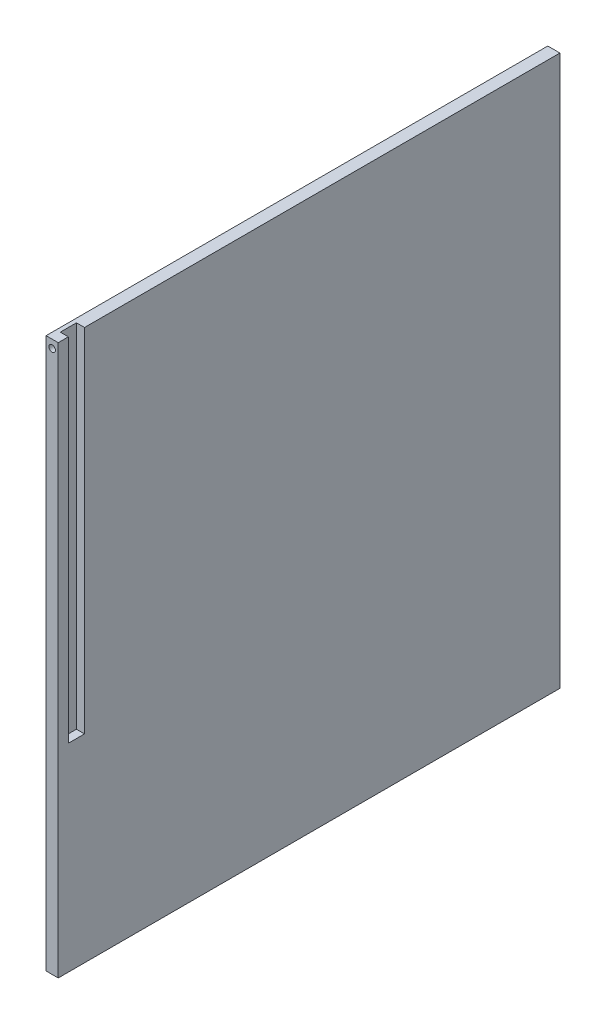
ISO-10303-21;
HEADER;
FILE_DESCRIPTION(('STEP AP214'),'2;1');
FILE_NAME('part.step','',(''),(''),'','','');
FILE_SCHEMA(('AUTOMOTIVE_DESIGN { 1 0 10303 214 1 1 1 1 }'));
ENDSEC;
DATA;
#1=APPLICATION_CONTEXT('core data for automotive mechanical design processes');
#2=APPLICATION_PROTOCOL_DEFINITION('international standard','automotive_design',2000,#1);
#3=PRODUCT_CONTEXT('',#1,'mechanical');
#4=PRODUCT('Part','Part','',(#3));
#5=PRODUCT_RELATED_PRODUCT_CATEGORY('part','',(#4));
#6=PRODUCT_DEFINITION_FORMATION('','',#4);
#7=PRODUCT_DEFINITION_CONTEXT('part definition',#1,'design');
#8=PRODUCT_DEFINITION('design','',#6,#7);
#9=PRODUCT_DEFINITION_SHAPE('','',#8);
#10=(LENGTH_UNIT() NAMED_UNIT(*) SI_UNIT(.MILLI.,.METRE.));
#11=(NAMED_UNIT(*) PLANE_ANGLE_UNIT() SI_UNIT($,.RADIAN.));
#12=(NAMED_UNIT(*) SI_UNIT($,.STERADIAN.) SOLID_ANGLE_UNIT());
#13=UNCERTAINTY_MEASURE_WITH_UNIT(LENGTH_MEASURE(1.E-05),#10,'distance_accuracy_value','');
#14=(GEOMETRIC_REPRESENTATION_CONTEXT(3) GLOBAL_UNCERTAINTY_ASSIGNED_CONTEXT((#13)) GLOBAL_UNIT_ASSIGNED_CONTEXT((#10,
#11,#12)) REPRESENTATION_CONTEXT('',''));
#15=CARTESIAN_POINT('',(0.,0.,0.));
#16=DIRECTION('',(0.,0.,1.));
#17=DIRECTION('',(1.,0.,0.));
#18=AXIS2_PLACEMENT_3D('',#15,#16,#17);
#19=CARTESIAN_POINT('',(15.,0.,310.));
#20=DIRECTION('',(0.,0.,-1.));
#21=DIRECTION('',(-1.,0.,0.));
#22=AXIS2_PLACEMENT_3D('',#19,#20,#21);
#23=PLANE('',#22);
#24=CARTESIAN_POINT('',(7.5,670.,310.));
#25=DIRECTION('',(0.,0.,1.));
#26=DIRECTION('',(1.,0.,0.));
#27=AXIS2_PLACEMENT_3D('',#24,#25,#26);
#28=CIRCLE('',#27,4.);
#29=CARTESIAN_POINT('',(11.5,670.,310.));
#30=VERTEX_POINT('',#29);
#31=EDGE_CURVE('E174',#30,#30,#28,.T.);
#32=ORIENTED_EDGE('',*,*,#31,.F.);
#33=EDGE_LOOP('',(#32));
#34=FACE_BOUND('',#33,.T.);
#35=DIRECTION('',(0.,-1.,0.));
#36=VECTOR('',#35,1.);
#37=CARTESIAN_POINT('',(0.,0.,310.));
#38=LINE('',#37,#36);
#39=CARTESIAN_POINT('',(0.,680.,310.));
#40=VERTEX_POINT('',#39);
#41=CARTESIAN_POINT('',(0.,0.,310.));
#42=VERTEX_POINT('',#41);
#43=EDGE_CURVE('E145',#40,#42,#38,.T.);
#44=ORIENTED_EDGE('',*,*,#43,.T.);
#45=DIRECTION('',(-1.,0.,0.));
#46=VECTOR('',#45,1.);
#47=CARTESIAN_POINT('',(15.,0.,310.));
#48=LINE('',#47,#46);
#49=CARTESIAN_POINT('',(15.,0.,310.));
#50=VERTEX_POINT('',#49);
#51=EDGE_CURVE('E12',#50,#42,#48,.T.);
#52=ORIENTED_EDGE('',*,*,#51,.F.);
#53=DIRECTION('',(0.,-1.,0.));
#54=VECTOR('',#53,1.);
#55=CARTESIAN_POINT('',(15.,0.,310.));
#56=LINE('',#55,#54);
#57=CARTESIAN_POINT('',(15.,680.,310.));
#58=VERTEX_POINT('',#57);
#59=EDGE_CURVE('E153',#58,#50,#56,.T.);
#60=ORIENTED_EDGE('',*,*,#59,.F.);
#61=DIRECTION('',(-1.,0.,0.));
#62=VECTOR('',#61,1.);
#63=CARTESIAN_POINT('',(15.,680.,310.));
#64=LINE('',#63,#62);
#65=EDGE_CURVE('E138',#58,#40,#64,.T.);
#66=ORIENTED_EDGE('',*,*,#65,.T.);
#67=EDGE_LOOP('',(#44,#52,#60,#66));
#68=FACE_BOUND('',#67,.T.);
#69=ADVANCED_FACE('F40',(#34,#68),#23,.F.);
#70=CARTESIAN_POINT('',(15.,0.,310.));
#71=DIRECTION('',(0.,1.,0.));
#72=DIRECTION('',(0.,0.,1.));
#73=AXIS2_PLACEMENT_3D('',#70,#71,#72);
#74=PLANE('',#73);
#75=DIRECTION('',(0.,0.,-1.));
#76=VECTOR('',#75,1.);
#77=CARTESIAN_POINT('',(0.,0.,310.));
#78=LINE('',#77,#76);
#79=CARTESIAN_POINT('',(0.,0.,-310.));
#80=VERTEX_POINT('',#79);
#81=EDGE_CURVE('E148',#42,#80,#78,.T.);
#82=ORIENTED_EDGE('',*,*,#81,.T.);
#83=DIRECTION('',(-1.,0.,0.));
#84=VECTOR('',#83,1.);
#85=CARTESIAN_POINT('',(15.,0.,-310.));
#86=LINE('',#85,#84);
#87=CARTESIAN_POINT('',(15.,0.,-310.));
#88=VERTEX_POINT('',#87);
#89=EDGE_CURVE('E47',#88,#80,#86,.T.);
#90=ORIENTED_EDGE('',*,*,#89,.F.);
#91=DIRECTION('',(0.,0.,-1.));
#92=VECTOR('',#91,1.);
#93=CARTESIAN_POINT('',(15.,0.,310.));
#94=LINE('',#93,#92);
#95=EDGE_CURVE('E91',#50,#88,#94,.T.);
#96=ORIENTED_EDGE('',*,*,#95,.F.);
#97=ORIENTED_EDGE('',*,*,#51,.T.);
#98=EDGE_LOOP('',(#82,#90,#96,#97));
#99=FACE_BOUND('',#98,.T.);
#100=ADVANCED_FACE('F235',(#99),#74,.F.);
#101=CARTESIAN_POINT('',(15.,0.,-310.));
#102=DIRECTION('',(0.,0.,1.));
#103=DIRECTION('',(1.,0.,0.));
#104=AXIS2_PLACEMENT_3D('',#101,#102,#103);
#105=PLANE('',#104);
#106=CARTESIAN_POINT('',(7.5,665.,-310.));
#107=DIRECTION('',(0.,0.,-1.));
#108=DIRECTION('',(-1.,0.,0.));
#109=AXIS2_PLACEMENT_3D('',#106,#107,#108);
#110=CIRCLE('',#109,4.);
#111=CARTESIAN_POINT('',(3.5,665.,-310.));
#112=VERTEX_POINT('',#111);
#113=EDGE_CURVE('E179',#112,#112,#110,.T.);
#114=ORIENTED_EDGE('',*,*,#113,.F.);
#115=EDGE_LOOP('',(#114));
#116=FACE_BOUND('',#115,.T.);
#117=CARTESIAN_POINT('',(7.5,340.,-310.));
#118=DIRECTION('',(0.,0.,-1.));
#119=DIRECTION('',(-1.,0.,0.));
#120=AXIS2_PLACEMENT_3D('',#117,#118,#119);
#121=CIRCLE('',#120,4.);
#122=CARTESIAN_POINT('',(3.5,340.,-310.));
#123=VERTEX_POINT('',#122);
#124=EDGE_CURVE('E187',#123,#123,#121,.T.);
#125=ORIENTED_EDGE('',*,*,#124,.F.);
#126=EDGE_LOOP('',(#125));
#127=FACE_BOUND('',#126,.T.);
#128=CARTESIAN_POINT('',(7.5,15.,-310.));
#129=DIRECTION('',(0.,0.,-1.));
#130=DIRECTION('',(-1.,0.,0.));
#131=AXIS2_PLACEMENT_3D('',#128,#129,#130);
#132=CIRCLE('',#131,4.);
#133=CARTESIAN_POINT('',(3.5,15.,-310.));
#134=VERTEX_POINT('',#133);
#135=EDGE_CURVE('E193',#134,#134,#132,.T.);
#136=ORIENTED_EDGE('',*,*,#135,.F.);
#137=EDGE_LOOP('',(#136));
#138=FACE_BOUND('',#137,.T.);
#139=DIRECTION('',(0.,1.,0.));
#140=VECTOR('',#139,1.);
#141=CARTESIAN_POINT('',(0.,0.,-310.));
#142=LINE('',#141,#140);
#143=CARTESIAN_POINT('',(0.,680.,-310.));
#144=VERTEX_POINT('',#143);
#145=EDGE_CURVE('E151',#80,#144,#142,.T.);
#146=ORIENTED_EDGE('',*,*,#145,.T.);
#147=DIRECTION('',(-1.,0.,0.));
#148=VECTOR('',#147,1.);
#149=CARTESIAN_POINT('',(15.,680.,-310.));
#150=LINE('',#149,#148);
#151=CARTESIAN_POINT('',(15.,680.,-310.));
#152=VERTEX_POINT('',#151);
#153=EDGE_CURVE('E140',#152,#144,#150,.T.);
#154=ORIENTED_EDGE('',*,*,#153,.F.);
#155=DIRECTION('',(0.,1.,0.));
#156=VECTOR('',#155,1.);
#157=CARTESIAN_POINT('',(15.,0.,-310.));
#158=LINE('',#157,#156);
#159=EDGE_CURVE('E136',#88,#152,#158,.T.);
#160=ORIENTED_EDGE('',*,*,#159,.F.);
#161=ORIENTED_EDGE('',*,*,#89,.T.);
#162=EDGE_LOOP('',(#146,#154,#160,#161));
#163=FACE_BOUND('',#162,.T.);
#164=ADVANCED_FACE('F158',(#116,#127,#138,#163),#105,.F.);
#165=CARTESIAN_POINT('',(15.,680.,310.));
#166=DIRECTION('',(0.,-1.,0.));
#167=DIRECTION('',(0.,0.,-1.));
#168=AXIS2_PLACEMENT_3D('',#165,#166,#167);
#169=PLANE('',#168);
#170=DIRECTION('',(0.,0.,1.));
#171=VECTOR('',#170,1.);
#172=CARTESIAN_POINT('',(15.,680.,310.));
#173=LINE('',#172,#171);
#174=CARTESIAN_POINT('',(15.,680.,297.5));
#175=VERTEX_POINT('',#174);
#176=EDGE_CURVE('E62',#175,#58,#173,.T.);
#177=ORIENTED_EDGE('',*,*,#176,.F.);
#178=DIRECTION('',(1.,0.,0.));
#179=VECTOR('',#178,1.);
#180=CARTESIAN_POINT('',(15.,680.,297.5));
#181=LINE('',#180,#179);
#182=CARTESIAN_POINT('',(5.,680.,297.5));
#183=VERTEX_POINT('',#182);
#184=EDGE_CURVE('E125',#183,#175,#181,.T.);
#185=ORIENTED_EDGE('',*,*,#184,.F.);
#186=DIRECTION('',(0.,0.,1.));
#187=VECTOR('',#186,1.);
#188=CARTESIAN_POINT('',(5.,680.,297.5));
#189=LINE('',#188,#187);
#190=CARTESIAN_POINT('',(4.99999999999999,680.,277.5));
#191=VERTEX_POINT('',#190);
#192=EDGE_CURVE('E132',#191,#183,#189,.T.);
#193=ORIENTED_EDGE('',*,*,#192,.F.);
#194=DIRECTION('',(-1.,0.,0.));
#195=VECTOR('',#194,1.);
#196=CARTESIAN_POINT('',(15.,680.,277.5));
#197=LINE('',#196,#195);
#198=CARTESIAN_POINT('',(15.,680.,277.5));
#199=VERTEX_POINT('',#198);
#200=EDGE_CURVE('E117',#199,#191,#197,.T.);
#201=ORIENTED_EDGE('',*,*,#200,.F.);
#202=EDGE_CURVE('E129',#152,#199,#173,.T.);
#203=ORIENTED_EDGE('',*,*,#202,.F.);
#204=ORIENTED_EDGE('',*,*,#153,.T.);
#205=DIRECTION('',(0.,0.,1.));
#206=VECTOR('',#205,1.);
#207=CARTESIAN_POINT('',(0.,680.,310.));
#208=LINE('',#207,#206);
#209=EDGE_CURVE('E84',#144,#40,#208,.T.);
#210=ORIENTED_EDGE('',*,*,#209,.T.);
#211=ORIENTED_EDGE('',*,*,#65,.F.);
#212=EDGE_LOOP('',(#177,#185,#193,#201,#203,#204,#210,#211));
#213=FACE_BOUND('',#212,.T.);
#214=ADVANCED_FACE('F128',(#213),#169,.F.);
#215=CARTESIAN_POINT('',(15.,0.,0.));
#216=DIRECTION('',(-1.,0.,0.));
#217=DIRECTION('',(0.,0.,1.));
#218=AXIS2_PLACEMENT_3D('',#215,#216,#217);
#219=PLANE('',#218);
#220=DIRECTION('',(0.,0.,1.));
#221=VECTOR('',#220,1.);
#222=CARTESIAN_POINT('',(15.,245.,297.5));
#223=LINE('',#222,#221);
#224=CARTESIAN_POINT('',(15.,245.,277.5));
#225=VERTEX_POINT('',#224);
#226=CARTESIAN_POINT('',(15.,245.,297.5));
#227=VERTEX_POINT('',#226);
#228=EDGE_CURVE('E175',#225,#227,#223,.T.);
#229=ORIENTED_EDGE('',*,*,#228,.T.);
#230=DIRECTION('',(0.,1.,0.));
#231=VECTOR('',#230,1.);
#232=CARTESIAN_POINT('',(15.,-22.3606797749979,297.5));
#233=LINE('',#232,#231);
#234=EDGE_CURVE('E54',#227,#175,#233,.T.);
#235=ORIENTED_EDGE('',*,*,#234,.T.);
#236=ORIENTED_EDGE('',*,*,#176,.T.);
#237=ORIENTED_EDGE('',*,*,#59,.T.);
#238=ORIENTED_EDGE('',*,*,#95,.T.);
#239=ORIENTED_EDGE('',*,*,#159,.T.);
#240=ORIENTED_EDGE('',*,*,#202,.T.);
#241=DIRECTION('',(0.,1.,0.));
#242=VECTOR('',#241,1.);
#243=CARTESIAN_POINT('',(15.,-22.3606797749979,277.5));
#244=LINE('',#243,#242);
#245=EDGE_CURVE('E113',#225,#199,#244,.T.);
#246=ORIENTED_EDGE('',*,*,#245,.F.);
#247=EDGE_LOOP('',(#229,#235,#236,#237,#238,#239,#240,#246));
#248=FACE_BOUND('',#247,.T.);
#249=ADVANCED_FACE('F134',(#248),#219,.F.);
#250=CARTESIAN_POINT('',(0.,0.,0.));
#251=DIRECTION('',(-1.,0.,0.));
#252=DIRECTION('',(0.,0.,1.));
#253=AXIS2_PLACEMENT_3D('',#250,#251,#252);
#254=PLANE('',#253);
#255=CARTESIAN_POINT('',(0.,7.5,-295.));
#256=DIRECTION('',(-1.,0.,0.));
#257=DIRECTION('',(0.,0.,1.));
#258=AXIS2_PLACEMENT_3D('',#255,#256,#257);
#259=CIRCLE('',#258,3.99999999999999);
#260=CARTESIAN_POINT('',(0.,7.5,-291.));
#261=VERTEX_POINT('',#260);
#262=EDGE_CURVE('E197',#261,#261,#259,.T.);
#263=ORIENTED_EDGE('',*,*,#262,.F.);
#264=EDGE_LOOP('',(#263));
#265=FACE_BOUND('',#264,.T.);
#266=CARTESIAN_POINT('',(0.,7.5,0.));
#267=DIRECTION('',(-1.,0.,0.));
#268=DIRECTION('',(0.,0.,1.));
#269=AXIS2_PLACEMENT_3D('',#266,#267,#268);
#270=CIRCLE('',#269,3.99999999999999);
#271=CARTESIAN_POINT('',(0.,7.5,3.99999999999999));
#272=VERTEX_POINT('',#271);
#273=EDGE_CURVE('E205',#272,#272,#270,.T.);
#274=ORIENTED_EDGE('',*,*,#273,.F.);
#275=EDGE_LOOP('',(#274));
#276=FACE_BOUND('',#275,.T.);
#277=CARTESIAN_POINT('',(0.,7.5,295.));
#278=DIRECTION('',(-1.,0.,0.));
#279=DIRECTION('',(0.,0.,1.));
#280=AXIS2_PLACEMENT_3D('',#277,#278,#279);
#281=CIRCLE('',#280,3.99999999999999);
#282=CARTESIAN_POINT('',(0.,7.5,299.));
#283=VERTEX_POINT('',#282);
#284=EDGE_CURVE('E211',#283,#283,#281,.T.);
#285=ORIENTED_EDGE('',*,*,#284,.F.);
#286=EDGE_LOOP('',(#285));
#287=FACE_BOUND('',#286,.T.);
#288=ORIENTED_EDGE('',*,*,#43,.F.);
#289=ORIENTED_EDGE('',*,*,#209,.F.);
#290=ORIENTED_EDGE('',*,*,#145,.F.);
#291=ORIENTED_EDGE('',*,*,#81,.F.);
#292=EDGE_LOOP('',(#288,#289,#290,#291));
#293=FACE_BOUND('',#292,.T.);
#294=ADVANCED_FACE('F161',(#265,#276,#287,#293),#254,.T.);
#295=CARTESIAN_POINT('',(10.,7.5,295.));
#296=DIRECTION('',(-1.,0.,0.));
#297=DIRECTION('',(0.,0.,1.));
#298=AXIS2_PLACEMENT_3D('',#295,#296,#297);
#299=CYLINDRICAL_SURFACE('',#298,3.99999999999999);
#300=CARTESIAN_POINT('',(10.,7.5,295.));
#301=DIRECTION('',(-1.,0.,0.));
#302=DIRECTION('',(0.,0.,1.));
#303=AXIS2_PLACEMENT_3D('',#300,#301,#302);
#304=CIRCLE('',#303,3.99999999999999);
#305=CARTESIAN_POINT('',(10.,7.5,299.));
#306=VERTEX_POINT('',#305);
#307=EDGE_CURVE('E149',#306,#306,#304,.T.);
#308=ORIENTED_EDGE('',*,*,#307,.F.);
#309=EDGE_LOOP('',(#308));
#310=FACE_BOUND('',#309,.T.);
#311=ORIENTED_EDGE('',*,*,#284,.T.);
#312=EDGE_LOOP('',(#311));
#313=FACE_BOUND('',#312,.T.);
#314=ADVANCED_FACE('F218',(#310,#313),#299,.F.);
#315=CARTESIAN_POINT('',(10.,7.5,295.));
#316=DIRECTION('',(-1.,0.,0.));
#317=DIRECTION('',(0.,0.,1.));
#318=AXIS2_PLACEMENT_3D('',#315,#316,#317);
#319=PLANE('',#318);
#320=ORIENTED_EDGE('',*,*,#307,.T.);
#321=EDGE_LOOP('',(#320));
#322=FACE_BOUND('',#321,.T.);
#323=ADVANCED_FACE('F227',(#322),#319,.T.);
#324=CARTESIAN_POINT('',(10.,7.5,0.));
#325=DIRECTION('',(-1.,0.,0.));
#326=DIRECTION('',(0.,0.,1.));
#327=AXIS2_PLACEMENT_3D('',#324,#325,#326);
#328=CYLINDRICAL_SURFACE('',#327,3.99999999999999);
#329=CARTESIAN_POINT('',(10.,7.5,0.));
#330=DIRECTION('',(-1.,0.,0.));
#331=DIRECTION('',(0.,0.,1.));
#332=AXIS2_PLACEMENT_3D('',#329,#330,#331);
#333=CIRCLE('',#332,3.99999999999999);
#334=CARTESIAN_POINT('',(10.,7.5,3.99999999999999));
#335=VERTEX_POINT('',#334);
#336=EDGE_CURVE('E208',#335,#335,#333,.T.);
#337=ORIENTED_EDGE('',*,*,#336,.F.);
#338=EDGE_LOOP('',(#337));
#339=FACE_BOUND('',#338,.T.);
#340=ORIENTED_EDGE('',*,*,#273,.T.);
#341=EDGE_LOOP('',(#340));
#342=FACE_BOUND('',#341,.T.);
#343=ADVANCED_FACE('F291',(#339,#342),#328,.F.);
#344=CARTESIAN_POINT('',(10.,7.5,0.));
#345=DIRECTION('',(-1.,0.,0.));
#346=DIRECTION('',(0.,0.,1.));
#347=AXIS2_PLACEMENT_3D('',#344,#345,#346);
#348=PLANE('',#347);
#349=ORIENTED_EDGE('',*,*,#336,.T.);
#350=EDGE_LOOP('',(#349));
#351=FACE_BOUND('',#350,.T.);
#352=ADVANCED_FACE('F287',(#351),#348,.T.);
#353=CARTESIAN_POINT('',(10.,7.5,-295.));
#354=DIRECTION('',(-1.,0.,0.));
#355=DIRECTION('',(0.,0.,1.));
#356=AXIS2_PLACEMENT_3D('',#353,#354,#355);
#357=CYLINDRICAL_SURFACE('',#356,3.99999999999999);
#358=CARTESIAN_POINT('',(10.,7.5,-295.));
#359=DIRECTION('',(-1.,0.,0.));
#360=DIRECTION('',(0.,0.,1.));
#361=AXIS2_PLACEMENT_3D('',#358,#359,#360);
#362=CIRCLE('',#361,3.99999999999999);
#363=CARTESIAN_POINT('',(10.,7.5,-291.));
#364=VERTEX_POINT('',#363);
#365=EDGE_CURVE('E202',#364,#364,#362,.T.);
#366=ORIENTED_EDGE('',*,*,#365,.F.);
#367=EDGE_LOOP('',(#366));
#368=FACE_BOUND('',#367,.T.);
#369=ORIENTED_EDGE('',*,*,#262,.T.);
#370=EDGE_LOOP('',(#369));
#371=FACE_BOUND('',#370,.T.);
#372=ADVANCED_FACE('F283',(#368,#371),#357,.F.);
#373=CARTESIAN_POINT('',(10.,7.5,-295.));
#374=DIRECTION('',(-1.,0.,0.));
#375=DIRECTION('',(0.,0.,1.));
#376=AXIS2_PLACEMENT_3D('',#373,#374,#375);
#377=PLANE('',#376);
#378=ORIENTED_EDGE('',*,*,#365,.T.);
#379=EDGE_LOOP('',(#378));
#380=FACE_BOUND('',#379,.T.);
#381=ADVANCED_FACE('F279',(#380),#377,.T.);
#382=CARTESIAN_POINT('',(7.5,15.,-300.));
#383=DIRECTION('',(0.,0.,-1.));
#384=DIRECTION('',(-1.,0.,0.));
#385=AXIS2_PLACEMENT_3D('',#382,#383,#384);
#386=CYLINDRICAL_SURFACE('',#385,4.);
#387=CARTESIAN_POINT('',(7.5,15.,-300.));
#388=DIRECTION('',(0.,0.,-1.));
#389=DIRECTION('',(-1.,0.,0.));
#390=AXIS2_PLACEMENT_3D('',#387,#388,#389);
#391=CIRCLE('',#390,4.);
#392=CARTESIAN_POINT('',(3.5,15.,-300.));
#393=VERTEX_POINT('',#392);
#394=EDGE_CURVE('E194',#393,#393,#391,.T.);
#395=ORIENTED_EDGE('',*,*,#394,.F.);
#396=EDGE_LOOP('',(#395));
#397=FACE_BOUND('',#396,.T.);
#398=ORIENTED_EDGE('',*,*,#135,.T.);
#399=EDGE_LOOP('',(#398));
#400=FACE_BOUND('',#399,.T.);
#401=ADVANCED_FACE('F275',(#397,#400),#386,.F.);
#402=CARTESIAN_POINT('',(7.5,15.,-300.));
#403=DIRECTION('',(0.,0.,-1.));
#404=DIRECTION('',(-1.,0.,0.));
#405=AXIS2_PLACEMENT_3D('',#402,#403,#404);
#406=PLANE('',#405);
#407=ORIENTED_EDGE('',*,*,#394,.T.);
#408=EDGE_LOOP('',(#407));
#409=FACE_BOUND('',#408,.T.);
#410=ADVANCED_FACE('F271',(#409),#406,.T.);
#411=CARTESIAN_POINT('',(7.5,340.,-300.));
#412=DIRECTION('',(0.,0.,-1.));
#413=DIRECTION('',(-1.,0.,0.));
#414=AXIS2_PLACEMENT_3D('',#411,#412,#413);
#415=CYLINDRICAL_SURFACE('',#414,4.);
#416=CARTESIAN_POINT('',(7.5,340.,-300.));
#417=DIRECTION('',(0.,0.,-1.));
#418=DIRECTION('',(-1.,0.,0.));
#419=AXIS2_PLACEMENT_3D('',#416,#417,#418);
#420=CIRCLE('',#419,4.);
#421=CARTESIAN_POINT('',(3.5,340.,-300.));
#422=VERTEX_POINT('',#421);
#423=EDGE_CURVE('E190',#422,#422,#420,.T.);
#424=ORIENTED_EDGE('',*,*,#423,.F.);
#425=EDGE_LOOP('',(#424));
#426=FACE_BOUND('',#425,.T.);
#427=ORIENTED_EDGE('',*,*,#124,.T.);
#428=EDGE_LOOP('',(#427));
#429=FACE_BOUND('',#428,.T.);
#430=ADVANCED_FACE('F267',(#426,#429),#415,.F.);
#431=CARTESIAN_POINT('',(7.5,340.,-300.));
#432=DIRECTION('',(0.,0.,-1.));
#433=DIRECTION('',(-1.,0.,0.));
#434=AXIS2_PLACEMENT_3D('',#431,#432,#433);
#435=PLANE('',#434);
#436=ORIENTED_EDGE('',*,*,#423,.T.);
#437=EDGE_LOOP('',(#436));
#438=FACE_BOUND('',#437,.T.);
#439=ADVANCED_FACE('F263',(#438),#435,.T.);
#440=CARTESIAN_POINT('',(7.5,665.,-300.));
#441=DIRECTION('',(0.,0.,-1.));
#442=DIRECTION('',(-1.,0.,0.));
#443=AXIS2_PLACEMENT_3D('',#440,#441,#442);
#444=CYLINDRICAL_SURFACE('',#443,4.);
#445=CARTESIAN_POINT('',(7.5,665.,-300.));
#446=DIRECTION('',(0.,0.,-1.));
#447=DIRECTION('',(-1.,0.,0.));
#448=AXIS2_PLACEMENT_3D('',#445,#446,#447);
#449=CIRCLE('',#448,4.);
#450=CARTESIAN_POINT('',(3.5,665.,-300.));
#451=VERTEX_POINT('',#450);
#452=EDGE_CURVE('E184',#451,#451,#449,.T.);
#453=ORIENTED_EDGE('',*,*,#452,.F.);
#454=EDGE_LOOP('',(#453));
#455=FACE_BOUND('',#454,.T.);
#456=ORIENTED_EDGE('',*,*,#113,.T.);
#457=EDGE_LOOP('',(#456));
#458=FACE_BOUND('',#457,.T.);
#459=ADVANCED_FACE('F255',(#455,#458),#444,.F.);
#460=CARTESIAN_POINT('',(7.5,665.,-300.));
#461=DIRECTION('',(0.,0.,-1.));
#462=DIRECTION('',(-1.,0.,0.));
#463=AXIS2_PLACEMENT_3D('',#460,#461,#462);
#464=PLANE('',#463);
#465=ORIENTED_EDGE('',*,*,#452,.T.);
#466=EDGE_LOOP('',(#465));
#467=FACE_BOUND('',#466,.T.);
#468=ADVANCED_FACE('F245',(#467),#464,.T.);
#469=CARTESIAN_POINT('',(7.5,670.,300.));
#470=DIRECTION('',(0.,0.,1.));
#471=DIRECTION('',(1.,0.,0.));
#472=AXIS2_PLACEMENT_3D('',#469,#470,#471);
#473=CYLINDRICAL_SURFACE('',#472,4.);
#474=CARTESIAN_POINT('',(7.5,670.,300.));
#475=DIRECTION('',(0.,0.,1.));
#476=DIRECTION('',(1.,0.,0.));
#477=AXIS2_PLACEMENT_3D('',#474,#475,#476);
#478=CIRCLE('',#477,4.);
#479=CARTESIAN_POINT('',(11.5,670.,300.));
#480=VERTEX_POINT('',#479);
#481=EDGE_CURVE('E176',#480,#480,#478,.T.);
#482=ORIENTED_EDGE('',*,*,#481,.F.);
#483=EDGE_LOOP('',(#482));
#484=FACE_BOUND('',#483,.T.);
#485=ORIENTED_EDGE('',*,*,#31,.T.);
#486=EDGE_LOOP('',(#485));
#487=FACE_BOUND('',#486,.T.);
#488=ADVANCED_FACE('F242',(#484,#487),#473,.F.);
#489=CARTESIAN_POINT('',(7.5,670.,300.));
#490=DIRECTION('',(0.,0.,1.));
#491=DIRECTION('',(1.,0.,0.));
#492=AXIS2_PLACEMENT_3D('',#489,#490,#491);
#493=PLANE('',#492);
#494=ORIENTED_EDGE('',*,*,#481,.T.);
#495=EDGE_LOOP('',(#494));
#496=FACE_BOUND('',#495,.T.);
#497=ADVANCED_FACE('F244',(#496),#493,.T.);
#498=CARTESIAN_POINT('',(15.,-22.3606797749979,297.5));
#499=DIRECTION('',(0.,0.,1.));
#500=DIRECTION('',(1.,0.,0.));
#501=AXIS2_PLACEMENT_3D('',#498,#499,#500);
#502=PLANE('',#501);
#503=DIRECTION('',(-1.,0.,0.));
#504=VECTOR('',#503,1.);
#505=CARTESIAN_POINT('',(15.,245.,297.5));
#506=LINE('',#505,#504);
#507=CARTESIAN_POINT('',(5.,245.,297.5));
#508=VERTEX_POINT('',#507);
#509=EDGE_CURVE('E509',#227,#508,#506,.T.);
#510=ORIENTED_EDGE('',*,*,#509,.T.);
#511=DIRECTION('',(0.,1.,0.));
#512=VECTOR('',#511,1.);
#513=CARTESIAN_POINT('',(5.,-22.3606797749979,297.5));
#514=LINE('',#513,#512);
#515=EDGE_CURVE('E170',#508,#183,#514,.T.);
#516=ORIENTED_EDGE('',*,*,#515,.T.);
#517=ORIENTED_EDGE('',*,*,#184,.T.);
#518=ORIENTED_EDGE('',*,*,#234,.F.);
#519=EDGE_LOOP('',(#510,#516,#517,#518));
#520=FACE_BOUND('',#519,.T.);
#521=ADVANCED_FACE('F252',(#520),#502,.F.);
#522=CARTESIAN_POINT('',(5.,-22.3606797749979,297.5));
#523=DIRECTION('',(-1.,0.,0.));
#524=DIRECTION('',(0.,0.,1.));
#525=AXIS2_PLACEMENT_3D('',#522,#523,#524);
#526=PLANE('',#525);
#527=DIRECTION('',(0.,0.,-1.));
#528=VECTOR('',#527,1.);
#529=CARTESIAN_POINT('',(5.,245.,297.5));
#530=LINE('',#529,#528);
#531=CARTESIAN_POINT('',(4.99999999999999,245.,277.5));
#532=VERTEX_POINT('',#531);
#533=EDGE_CURVE('E169',#508,#532,#530,.T.);
#534=ORIENTED_EDGE('',*,*,#533,.T.);
#535=DIRECTION('',(0.,1.,0.));
#536=VECTOR('',#535,1.);
#537=CARTESIAN_POINT('',(4.99999999999999,-22.3606797749979,277.5));
#538=LINE('',#537,#536);
#539=EDGE_CURVE('E124',#532,#191,#538,.T.);
#540=ORIENTED_EDGE('',*,*,#539,.T.);
#541=ORIENTED_EDGE('',*,*,#192,.T.);
#542=ORIENTED_EDGE('',*,*,#515,.F.);
#543=EDGE_LOOP('',(#534,#540,#541,#542));
#544=FACE_BOUND('',#543,.T.);
#545=ADVANCED_FACE('F390',(#544),#526,.F.);
#546=CARTESIAN_POINT('',(15.,-22.3606797749979,277.5));
#547=DIRECTION('',(0.,0.,-1.));
#548=DIRECTION('',(-1.,0.,0.));
#549=AXIS2_PLACEMENT_3D('',#546,#547,#548);
#550=PLANE('',#549);
#551=DIRECTION('',(1.,0.,0.));
#552=VECTOR('',#551,1.);
#553=CARTESIAN_POINT('',(15.,245.,277.5));
#554=LINE('',#553,#552);
#555=EDGE_CURVE('E120',#532,#225,#554,.T.);
#556=ORIENTED_EDGE('',*,*,#555,.T.);
#557=ORIENTED_EDGE('',*,*,#245,.T.);
#558=ORIENTED_EDGE('',*,*,#200,.T.);
#559=ORIENTED_EDGE('',*,*,#539,.F.);
#560=EDGE_LOOP('',(#556,#557,#558,#559));
#561=FACE_BOUND('',#560,.T.);
#562=ADVANCED_FACE('F115',(#561),#550,.F.);
#563=CARTESIAN_POINT('',(15.,245.,310.));
#564=DIRECTION('',(0.,1.,0.));
#565=DIRECTION('',(0.,0.,1.));
#566=AXIS2_PLACEMENT_3D('',#563,#564,#565);
#567=PLANE('',#566);
#568=ORIENTED_EDGE('',*,*,#228,.F.);
#569=ORIENTED_EDGE('',*,*,#555,.F.);
#570=ORIENTED_EDGE('',*,*,#533,.F.);
#571=ORIENTED_EDGE('',*,*,#509,.F.);
#572=EDGE_LOOP('',(#568,#569,#570,#571));
#573=FACE_BOUND('',#572,.T.);
#574=ADVANCED_FACE('F410',(#573),#567,.T.);
#575=CLOSED_SHELL('',(#69,#100,#164,#214,#249,#294,#314,#323,#343,#352,#372,#381,#401,#410,#430,
#439,#459,#468,#488,#497,#521,#545,#562,#574));
#576=MANIFOLD_SOLID_BREP('B2',#575);
#577=ADVANCED_BREP_SHAPE_REPRESENTATION('',(#18,#576),#14);
#578=SHAPE_DEFINITION_REPRESENTATION(#9,#577);
ENDSEC;
END-ISO-10303-21;
